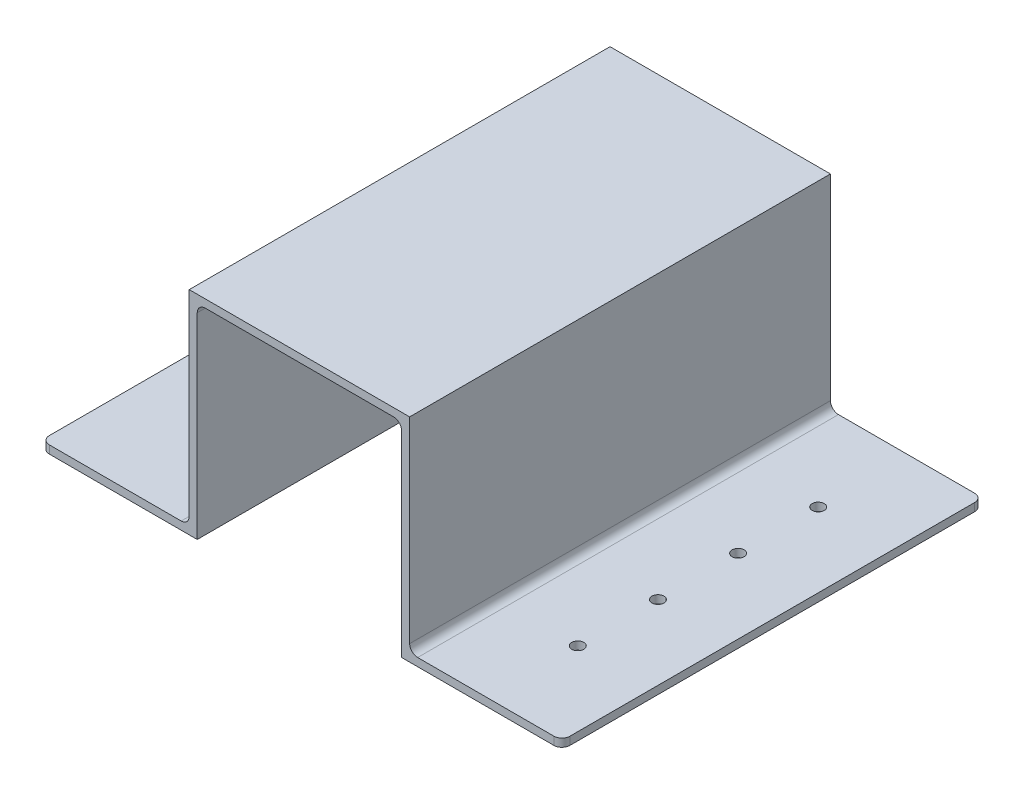
ISO-10303-21;
HEADER;
FILE_DESCRIPTION(('STEP AP214'),'2;1');
FILE_NAME('part.step','',(''),(''),'','','');
FILE_SCHEMA(('AUTOMOTIVE_DESIGN { 1 0 10303 214 1 1 1 1 }'));
ENDSEC;
DATA;
#1=APPLICATION_CONTEXT('core data for automotive mechanical design processes');
#2=APPLICATION_PROTOCOL_DEFINITION('international standard','automotive_design',2000,#1);
#3=PRODUCT_CONTEXT('',#1,'mechanical');
#4=PRODUCT('Part','Part','',(#3));
#5=PRODUCT_RELATED_PRODUCT_CATEGORY('part','',(#4));
#6=PRODUCT_DEFINITION_FORMATION('','',#4);
#7=PRODUCT_DEFINITION_CONTEXT('part definition',#1,'design');
#8=PRODUCT_DEFINITION('design','',#6,#7);
#9=PRODUCT_DEFINITION_SHAPE('','',#8);
#10=(LENGTH_UNIT() NAMED_UNIT(*) SI_UNIT(.MILLI.,.METRE.));
#11=(NAMED_UNIT(*) PLANE_ANGLE_UNIT() SI_UNIT($,.RADIAN.));
#12=(NAMED_UNIT(*) SI_UNIT($,.STERADIAN.) SOLID_ANGLE_UNIT());
#13=UNCERTAINTY_MEASURE_WITH_UNIT(LENGTH_MEASURE(1.E-05),#10,'distance_accuracy_value','');
#14=(GEOMETRIC_REPRESENTATION_CONTEXT(3) GLOBAL_UNCERTAINTY_ASSIGNED_CONTEXT((#13)) GLOBAL_UNIT_ASSIGNED_CONTEXT((#10,
#11,#12)) REPRESENTATION_CONTEXT('',''));
#15=CARTESIAN_POINT('',(0.,0.,0.));
#16=DIRECTION('',(0.,0.,1.));
#17=DIRECTION('',(1.,0.,0.));
#18=AXIS2_PLACEMENT_3D('',#15,#16,#17);
#19=CARTESIAN_POINT('',(-42.0847791453511,1.42606528480282,105.));
#20=DIRECTION('',(-1.,0.,0.));
#21=DIRECTION('',(0.,-1.,0.));
#22=AXIS2_PLACEMENT_3D('',#19,#20,#21);
#23=PLANE('',#22);
#24=DIRECTION('',(0.,1.,0.));
#25=VECTOR('',#24,1.);
#26=CARTESIAN_POINT('',(-42.0847791453511,1.42606528480282,0.));
#27=LINE('',#26,#25);
#28=CARTESIAN_POINT('',(-42.0847791453511,-49.5739347151972,0.));
#29=VERTEX_POINT('',#28);
#30=CARTESIAN_POINT('',(-42.0847791453511,-0.573934715197176,0.));
#31=VERTEX_POINT('',#30);
#32=EDGE_CURVE('E219',#29,#31,#27,.T.);
#33=ORIENTED_EDGE('',*,*,#32,.T.);
#34=DIRECTION('',(0.,0.,-1.));
#35=VECTOR('',#34,1.);
#36=CARTESIAN_POINT('',(-42.0847791453511,-0.573934715197176,105.));
#37=LINE('',#36,#35);
#38=CARTESIAN_POINT('',(-42.0847791453511,-0.573934715197176,105.));
#39=VERTEX_POINT('',#38);
#40=EDGE_CURVE('E272',#31,#39,#37,.F.);
#41=ORIENTED_EDGE('',*,*,#40,.T.);
#42=DIRECTION('',(0.,1.,0.));
#43=VECTOR('',#42,1.);
#44=CARTESIAN_POINT('',(-42.0847791453511,1.42606528480282,105.));
#45=LINE('',#44,#43);
#46=CARTESIAN_POINT('',(-42.0847791453511,-49.5739347151972,105.));
#47=VERTEX_POINT('',#46);
#48=EDGE_CURVE('E242',#47,#39,#45,.T.);
#49=ORIENTED_EDGE('',*,*,#48,.F.);
#50=DIRECTION('',(0.,0.,-1.));
#51=VECTOR('',#50,1.);
#52=CARTESIAN_POINT('',(-42.0847791453511,-49.5739347151972,105.));
#53=LINE('',#52,#51);
#54=EDGE_CURVE('E218',#47,#29,#53,.T.);
#55=ORIENTED_EDGE('',*,*,#54,.T.);
#56=EDGE_LOOP('',(#33,#41,#49,#55));
#57=FACE_BOUND('',#56,.T.);
#58=ADVANCED_FACE('F33',(#57),#23,.F.);
#59=CARTESIAN_POINT('',(-42.0847791453511,1.42606528480282,105.));
#60=DIRECTION('',(0.,1.,0.));
#61=DIRECTION('',(0.,0.,1.));
#62=AXIS2_PLACEMENT_3D('',#59,#60,#61);
#63=PLANE('',#62);
#64=DIRECTION('',(1.,0.,0.));
#65=VECTOR('',#64,1.);
#66=CARTESIAN_POINT('',(-42.0847791453511,1.42606528480282,0.));
#67=LINE('',#66,#65);
#68=CARTESIAN_POINT('',(-40.0847791453511,1.42606528480282,0.));
#69=VERTEX_POINT('',#68);
#70=CARTESIAN_POINT('',(6.91522085464886,1.42606528480282,0.));
#71=VERTEX_POINT('',#70);
#72=EDGE_CURVE('E222',#69,#71,#67,.T.);
#73=ORIENTED_EDGE('',*,*,#72,.T.);
#74=DIRECTION('',(0.,0.,-1.));
#75=VECTOR('',#74,1.);
#76=CARTESIAN_POINT('',(6.91522085464887,1.42606528480282,105.));
#77=LINE('',#76,#75);
#78=CARTESIAN_POINT('',(6.91522085464886,1.42606528480282,105.));
#79=VERTEX_POINT('',#78);
#80=EDGE_CURVE('E280',#71,#79,#77,.F.);
#81=ORIENTED_EDGE('',*,*,#80,.T.);
#82=DIRECTION('',(1.,0.,0.));
#83=VECTOR('',#82,1.);
#84=CARTESIAN_POINT('',(-42.0847791453511,1.42606528480282,105.));
#85=LINE('',#84,#83);
#86=CARTESIAN_POINT('',(-40.0847791453511,1.42606528480282,105.));
#87=VERTEX_POINT('',#86);
#88=EDGE_CURVE('E184',#87,#79,#85,.T.);
#89=ORIENTED_EDGE('',*,*,#88,.F.);
#90=DIRECTION('',(0.,0.,-1.));
#91=VECTOR('',#90,1.);
#92=CARTESIAN_POINT('',(-40.0847791453511,1.42606528480282,0.));
#93=LINE('',#92,#91);
#94=EDGE_CURVE('E269',#87,#69,#93,.T.);
#95=ORIENTED_EDGE('',*,*,#94,.T.);
#96=EDGE_LOOP('',(#73,#81,#89,#95));
#97=FACE_BOUND('',#96,.T.);
#98=ADVANCED_FACE('F406',(#97),#63,.F.);
#99=CARTESIAN_POINT('',(8.91522085464887,1.42606528480282,105.));
#100=DIRECTION('',(1.,0.,0.));
#101=DIRECTION('',(0.,1.,0.));
#102=AXIS2_PLACEMENT_3D('',#99,#100,#101);
#103=PLANE('',#102);
#104=DIRECTION('',(0.,-1.,0.));
#105=VECTOR('',#104,1.);
#106=CARTESIAN_POINT('',(8.91522085464887,1.42606528480282,105.));
#107=LINE('',#106,#105);
#108=CARTESIAN_POINT('',(8.91522085464887,-0.573934715197176,105.));
#109=VERTEX_POINT('',#108);
#110=CARTESIAN_POINT('',(8.91522085464888,-49.5739347151972,105.));
#111=VERTEX_POINT('',#110);
#112=EDGE_CURVE('E171',#109,#111,#107,.T.);
#113=ORIENTED_EDGE('',*,*,#112,.F.);
#114=DIRECTION('',(0.,0.,-1.));
#115=VECTOR('',#114,1.);
#116=CARTESIAN_POINT('',(8.91522085464887,-0.573934715197176,0.));
#117=LINE('',#116,#115);
#118=CARTESIAN_POINT('',(8.91522085464887,-0.573934715197176,0.));
#119=VERTEX_POINT('',#118);
#120=EDGE_CURVE('E278',#109,#119,#117,.T.);
#121=ORIENTED_EDGE('',*,*,#120,.T.);
#122=DIRECTION('',(0.,-1.,0.));
#123=VECTOR('',#122,1.);
#124=CARTESIAN_POINT('',(8.91522085464887,1.42606528480282,0.));
#125=LINE('',#124,#123);
#126=CARTESIAN_POINT('',(8.91522085464888,-49.5739347151972,0.));
#127=VERTEX_POINT('',#126);
#128=EDGE_CURVE('E190',#119,#127,#125,.T.);
#129=ORIENTED_EDGE('',*,*,#128,.T.);
#130=DIRECTION('',(0.,0.,-1.));
#131=VECTOR('',#130,1.);
#132=CARTESIAN_POINT('',(8.91522085464888,-49.5739347151972,105.));
#133=LINE('',#132,#131);
#134=EDGE_CURVE('E187',#111,#127,#133,.T.);
#135=ORIENTED_EDGE('',*,*,#134,.F.);
#136=EDGE_LOOP('',(#113,#121,#129,#135));
#137=FACE_BOUND('',#136,.T.);
#138=ADVANCED_FACE('F188',(#137),#103,.F.);
#139=CARTESIAN_POINT('',(8.91522085464888,-49.5739347151972,105.));
#140=DIRECTION('',(0.,1.,0.));
#141=DIRECTION('',(0.,0.,1.));
#142=AXIS2_PLACEMENT_3D('',#139,#140,#141);
#143=PLANE('',#142);
#144=CARTESIAN_POINT('',(30.3725806176562,-49.5739347151972,82.5));
#145=DIRECTION('',(0.,1.,0.));
#146=DIRECTION('',(0.,0.,1.));
#147=AXIS2_PLACEMENT_3D('',#144,#145,#146);
#148=CIRCLE('',#147,1.5);
#149=CARTESIAN_POINT('',(30.3725806176562,-49.5739347151972,84.));
#150=VERTEX_POINT('',#149);
#151=EDGE_CURVE('E223',#150,#150,#148,.T.);
#152=ORIENTED_EDGE('',*,*,#151,.T.);
#153=EDGE_LOOP('',(#152));
#154=FACE_BOUND('',#153,.T.);
#155=CARTESIAN_POINT('',(30.3725806176562,-49.5739347151972,62.5));
#156=DIRECTION('',(0.,1.,0.));
#157=DIRECTION('',(0.,0.,1.));
#158=AXIS2_PLACEMENT_3D('',#155,#156,#157);
#159=CIRCLE('',#158,1.5);
#160=CARTESIAN_POINT('',(30.3725806176562,-49.5739347151972,64.));
#161=VERTEX_POINT('',#160);
#162=EDGE_CURVE('E412',#161,#161,#159,.T.);
#163=ORIENTED_EDGE('',*,*,#162,.T.);
#164=EDGE_LOOP('',(#163));
#165=FACE_BOUND('',#164,.T.);
#166=CARTESIAN_POINT('',(30.3725806176562,-49.5739347151972,42.5));
#167=DIRECTION('',(0.,1.,0.));
#168=DIRECTION('',(0.,0.,1.));
#169=AXIS2_PLACEMENT_3D('',#166,#167,#168);
#170=CIRCLE('',#169,1.5);
#171=CARTESIAN_POINT('',(30.3725806176562,-49.5739347151972,44.));
#172=VERTEX_POINT('',#171);
#173=EDGE_CURVE('E415',#172,#172,#170,.T.);
#174=ORIENTED_EDGE('',*,*,#173,.T.);
#175=EDGE_LOOP('',(#174));
#176=FACE_BOUND('',#175,.T.);
#177=CARTESIAN_POINT('',(30.3725806176562,-49.5739347151972,22.5));
#178=DIRECTION('',(0.,1.,0.));
#179=DIRECTION('',(0.,0.,1.));
#180=AXIS2_PLACEMENT_3D('',#177,#178,#179);
#181=CIRCLE('',#180,1.5);
#182=CARTESIAN_POINT('',(30.3725806176562,-49.5739347151972,24.));
#183=VERTEX_POINT('',#182);
#184=EDGE_CURVE('E310',#183,#183,#181,.T.);
#185=ORIENTED_EDGE('',*,*,#184,.T.);
#186=EDGE_LOOP('',(#185));
#187=FACE_BOUND('',#186,.T.);
#188=DIRECTION('',(0.,0.,-1.));
#189=VECTOR('',#188,1.);
#190=CARTESIAN_POINT('',(48.9152208546489,-49.5739347151972,105.));
#191=LINE('',#190,#189);
#192=CARTESIAN_POINT('',(48.9152208546489,-49.5739347151972,103.));
#193=VERTEX_POINT('',#192);
#194=CARTESIAN_POINT('',(48.9152208546489,-49.5739347151972,2.));
#195=VERTEX_POINT('',#194);
#196=EDGE_CURVE('E195',#193,#195,#191,.T.);
#197=ORIENTED_EDGE('',*,*,#196,.F.);
#198=CARTESIAN_POINT('',(46.9152208546489,-49.5739347151972,103.));
#199=DIRECTION('',(0.,1.,0.));
#200=DIRECTION('',(0.,0.,1.));
#201=AXIS2_PLACEMENT_3D('',#198,#199,#200);
#202=CIRCLE('',#201,2.);
#203=CARTESIAN_POINT('',(46.9152208546489,-49.5739347151972,105.));
#204=VERTEX_POINT('',#203);
#205=EDGE_CURVE('E200',#193,#204,#202,.F.);
#206=ORIENTED_EDGE('',*,*,#205,.T.);
#207=DIRECTION('',(1.,0.,0.));
#208=VECTOR('',#207,1.);
#209=CARTESIAN_POINT('',(8.91522085464888,-49.5739347151972,105.));
#210=LINE('',#209,#208);
#211=EDGE_CURVE('E176',#111,#204,#210,.T.);
#212=ORIENTED_EDGE('',*,*,#211,.F.);
#213=ORIENTED_EDGE('',*,*,#134,.T.);
#214=DIRECTION('',(1.,0.,0.));
#215=VECTOR('',#214,1.);
#216=CARTESIAN_POINT('',(8.91522085464888,-49.5739347151972,0.));
#217=LINE('',#216,#215);
#218=CARTESIAN_POINT('',(46.9152208546489,-49.5739347151972,0.));
#219=VERTEX_POINT('',#218);
#220=EDGE_CURVE('E227',#127,#219,#217,.T.);
#221=ORIENTED_EDGE('',*,*,#220,.T.);
#222=CARTESIAN_POINT('',(46.9152208546489,-49.5739347151972,2.));
#223=DIRECTION('',(0.,1.,0.));
#224=DIRECTION('',(0.,0.,1.));
#225=AXIS2_PLACEMENT_3D('',#222,#223,#224);
#226=CIRCLE('',#225,2.);
#227=EDGE_CURVE('E324',#219,#195,#226,.F.);
#228=ORIENTED_EDGE('',*,*,#227,.T.);
#229=EDGE_LOOP('',(#197,#206,#212,#213,#221,#228));
#230=FACE_BOUND('',#229,.T.);
#231=ADVANCED_FACE('F198',(#154,#165,#176,#187,#230),#143,.F.);
#232=CARTESIAN_POINT('',(48.9152208546489,-47.5739347151972,105.));
#233=DIRECTION('',(-1.,0.,0.));
#234=DIRECTION('',(0.,-1.,0.));
#235=AXIS2_PLACEMENT_3D('',#232,#233,#234);
#236=PLANE('',#235);
#237=DIRECTION('',(0.,0.,-1.));
#238=VECTOR('',#237,1.);
#239=CARTESIAN_POINT('',(48.9152208546489,-47.5739347151972,105.));
#240=LINE('',#239,#238);
#241=CARTESIAN_POINT('',(48.9152208546489,-47.5739347151972,103.));
#242=VERTEX_POINT('',#241);
#243=CARTESIAN_POINT('',(48.9152208546489,-47.5739347151972,2.));
#244=VERTEX_POINT('',#243);
#245=EDGE_CURVE('E256',#242,#244,#240,.T.);
#246=ORIENTED_EDGE('',*,*,#245,.F.);
#247=DIRECTION('',(0.,1.,0.));
#248=VECTOR('',#247,1.);
#249=CARTESIAN_POINT('',(48.9152208546489,-47.5739347151972,103.));
#250=LINE('',#249,#248);
#251=EDGE_CURVE('E322',#242,#193,#250,.F.);
#252=ORIENTED_EDGE('',*,*,#251,.T.);
#253=ORIENTED_EDGE('',*,*,#196,.T.);
#254=DIRECTION('',(0.,1.,0.));
#255=VECTOR('',#254,1.);
#256=CARTESIAN_POINT('',(48.9152208546489,-47.5739347151972,2.));
#257=LINE('',#256,#255);
#258=EDGE_CURVE('E319',#195,#244,#257,.T.);
#259=ORIENTED_EDGE('',*,*,#258,.T.);
#260=EDGE_LOOP('',(#246,#252,#253,#259));
#261=FACE_BOUND('',#260,.T.);
#262=ADVANCED_FACE('F346',(#261),#236,.F.);
#263=CARTESIAN_POINT('',(10.9152208546489,-47.5739347151972,105.));
#264=DIRECTION('',(0.,-1.,0.));
#265=DIRECTION('',(0.,0.,-1.));
#266=AXIS2_PLACEMENT_3D('',#263,#264,#265);
#267=PLANE('',#266);
#268=CARTESIAN_POINT('',(30.3725806176562,-47.5739347151972,82.5));
#269=DIRECTION('',(0.,1.,0.));
#270=DIRECTION('',(0.,0.,1.));
#271=AXIS2_PLACEMENT_3D('',#268,#269,#270);
#272=CIRCLE('',#271,1.5);
#273=CARTESIAN_POINT('',(30.3725806176562,-47.5739347151972,84.));
#274=VERTEX_POINT('',#273);
#275=EDGE_CURVE('E429',#274,#274,#272,.T.);
#276=ORIENTED_EDGE('',*,*,#275,.F.);
#277=EDGE_LOOP('',(#276));
#278=FACE_BOUND('',#277,.T.);
#279=CARTESIAN_POINT('',(30.3725806176562,-47.5739347151972,62.5));
#280=DIRECTION('',(0.,1.,0.));
#281=DIRECTION('',(0.,0.,1.));
#282=AXIS2_PLACEMENT_3D('',#279,#280,#281);
#283=CIRCLE('',#282,1.5);
#284=CARTESIAN_POINT('',(30.3725806176562,-47.5739347151972,64.));
#285=VERTEX_POINT('',#284);
#286=EDGE_CURVE('E432',#285,#285,#283,.T.);
#287=ORIENTED_EDGE('',*,*,#286,.F.);
#288=EDGE_LOOP('',(#287));
#289=FACE_BOUND('',#288,.T.);
#290=CARTESIAN_POINT('',(30.3725806176562,-47.5739347151972,42.5));
#291=DIRECTION('',(0.,1.,0.));
#292=DIRECTION('',(0.,0.,-1.));
#293=AXIS2_PLACEMENT_3D('',#290,#291,#292);
#294=CIRCLE('',#293,1.5);
#295=CARTESIAN_POINT('',(30.3725806176562,-47.5739347151972,41.));
#296=VERTEX_POINT('',#295);
#297=EDGE_CURVE('E438',#296,#296,#294,.T.);
#298=ORIENTED_EDGE('',*,*,#297,.F.);
#299=EDGE_LOOP('',(#298));
#300=FACE_BOUND('',#299,.T.);
#301=CARTESIAN_POINT('',(30.3725806176562,-47.5739347151972,22.5));
#302=DIRECTION('',(0.,1.,0.));
#303=DIRECTION('',(0.,0.,-1.));
#304=AXIS2_PLACEMENT_3D('',#301,#302,#303);
#305=CIRCLE('',#304,1.5);
#306=CARTESIAN_POINT('',(30.3725806176562,-47.5739347151972,21.));
#307=VERTEX_POINT('',#306);
#308=EDGE_CURVE('E435',#307,#307,#305,.T.);
#309=ORIENTED_EDGE('',*,*,#308,.F.);
#310=EDGE_LOOP('',(#309));
#311=FACE_BOUND('',#310,.T.);
#312=DIRECTION('',(-1.,0.,0.));
#313=VECTOR('',#312,1.);
#314=CARTESIAN_POINT('',(10.9152208546489,-47.5739347151972,105.));
#315=LINE('',#314,#313);
#316=CARTESIAN_POINT('',(46.9152208546489,-47.5739347151972,105.));
#317=VERTEX_POINT('',#316);
#318=CARTESIAN_POINT('',(12.9152208546489,-47.5739347151972,105.));
#319=VERTEX_POINT('',#318);
#320=EDGE_CURVE('E201',#317,#319,#315,.T.);
#321=ORIENTED_EDGE('',*,*,#320,.F.);
#322=CARTESIAN_POINT('',(46.9152208546489,-47.5739347151972,103.));
#323=DIRECTION('',(0.,-1.,0.));
#324=DIRECTION('',(0.,0.,-1.));
#325=AXIS2_PLACEMENT_3D('',#322,#323,#324);
#326=CIRCLE('',#325,2.);
#327=EDGE_CURVE('E317',#317,#242,#326,.F.);
#328=ORIENTED_EDGE('',*,*,#327,.T.);
#329=ORIENTED_EDGE('',*,*,#245,.T.);
#330=CARTESIAN_POINT('',(46.9152208546489,-47.5739347151972,2.));
#331=DIRECTION('',(0.,-1.,0.));
#332=DIRECTION('',(0.,0.,-1.));
#333=AXIS2_PLACEMENT_3D('',#330,#331,#332);
#334=CIRCLE('',#333,2.);
#335=CARTESIAN_POINT('',(46.9152208546489,-47.5739347151972,0.));
#336=VERTEX_POINT('',#335);
#337=EDGE_CURVE('E315',#244,#336,#334,.F.);
#338=ORIENTED_EDGE('',*,*,#337,.T.);
#339=DIRECTION('',(-1.,0.,0.));
#340=VECTOR('',#339,1.);
#341=CARTESIAN_POINT('',(10.9152208546489,-47.5739347151972,0.));
#342=LINE('',#341,#340);
#343=CARTESIAN_POINT('',(12.9152208546489,-47.5739347151972,0.));
#344=VERTEX_POINT('',#343);
#345=EDGE_CURVE('E229',#336,#344,#342,.T.);
#346=ORIENTED_EDGE('',*,*,#345,.T.);
#347=DIRECTION('',(0.,0.,-1.));
#348=VECTOR('',#347,1.);
#349=CARTESIAN_POINT('',(12.9152208546489,-47.5739347151972,105.));
#350=LINE('',#349,#348);
#351=EDGE_CURVE('E288',#344,#319,#350,.F.);
#352=ORIENTED_EDGE('',*,*,#351,.T.);
#353=EDGE_LOOP('',(#321,#328,#329,#338,#346,#352));
#354=FACE_BOUND('',#353,.T.);
#355=ADVANCED_FACE('F350',(#278,#289,#300,#311,#354),#267,.F.);
#356=CARTESIAN_POINT('',(10.9152208546489,3.42606528480282,105.));
#357=DIRECTION('',(-1.,0.,0.));
#358=DIRECTION('',(0.,-1.,0.));
#359=AXIS2_PLACEMENT_3D('',#356,#357,#358);
#360=PLANE('',#359);
#361=DIRECTION('',(0.,1.,0.));
#362=VECTOR('',#361,1.);
#363=CARTESIAN_POINT('',(10.9152208546489,3.42606528480282,105.));
#364=LINE('',#363,#362);
#365=CARTESIAN_POINT('',(10.9152208546489,-45.5739347151972,105.));
#366=VERTEX_POINT('',#365);
#367=CARTESIAN_POINT('',(10.9152208546489,3.42606528480282,105.));
#368=VERTEX_POINT('',#367);
#369=EDGE_CURVE('E203',#366,#368,#364,.T.);
#370=ORIENTED_EDGE('',*,*,#369,.F.);
#371=DIRECTION('',(0.,0.,-1.));
#372=VECTOR('',#371,1.);
#373=CARTESIAN_POINT('',(10.9152208546489,-45.5739347151972,0.));
#374=LINE('',#373,#372);
#375=CARTESIAN_POINT('',(10.9152208546489,-45.5739347151972,0.));
#376=VERTEX_POINT('',#375);
#377=EDGE_CURVE('E285',#366,#376,#374,.T.);
#378=ORIENTED_EDGE('',*,*,#377,.T.);
#379=DIRECTION('',(0.,1.,0.));
#380=VECTOR('',#379,1.);
#381=CARTESIAN_POINT('',(10.9152208546489,3.42606528480282,0.));
#382=LINE('',#381,#380);
#383=CARTESIAN_POINT('',(10.9152208546489,3.42606528480282,0.));
#384=VERTEX_POINT('',#383);
#385=EDGE_CURVE('E231',#376,#384,#382,.T.);
#386=ORIENTED_EDGE('',*,*,#385,.T.);
#387=DIRECTION('',(0.,0.,-1.));
#388=VECTOR('',#387,1.);
#389=CARTESIAN_POINT('',(10.9152208546489,3.42606528480282,105.));
#390=LINE('',#389,#388);
#391=EDGE_CURVE('E253',#368,#384,#390,.T.);
#392=ORIENTED_EDGE('',*,*,#391,.F.);
#393=EDGE_LOOP('',(#370,#378,#386,#392));
#394=FACE_BOUND('',#393,.T.);
#395=ADVANCED_FACE('F361',(#394),#360,.F.);
#396=CARTESIAN_POINT('',(-44.0847791453511,3.42606528480282,105.));
#397=DIRECTION('',(0.,-1.,0.));
#398=DIRECTION('',(0.,0.,-1.));
#399=AXIS2_PLACEMENT_3D('',#396,#397,#398);
#400=PLANE('',#399);
#401=DIRECTION('',(-1.,0.,0.));
#402=VECTOR('',#401,1.);
#403=CARTESIAN_POINT('',(-44.0847791453511,3.42606528480282,0.));
#404=LINE('',#403,#402);
#405=CARTESIAN_POINT('',(-44.0847791453511,3.42606528480282,0.));
#406=VERTEX_POINT('',#405);
#407=EDGE_CURVE('E233',#384,#406,#404,.T.);
#408=ORIENTED_EDGE('',*,*,#407,.T.);
#409=DIRECTION('',(0.,0.,-1.));
#410=VECTOR('',#409,1.);
#411=CARTESIAN_POINT('',(-44.0847791453511,3.42606528480282,105.));
#412=LINE('',#411,#410);
#413=CARTESIAN_POINT('',(-44.0847791453511,3.42606528480282,105.));
#414=VERTEX_POINT('',#413);
#415=EDGE_CURVE('E250',#414,#406,#412,.T.);
#416=ORIENTED_EDGE('',*,*,#415,.F.);
#417=DIRECTION('',(-1.,0.,0.));
#418=VECTOR('',#417,1.);
#419=CARTESIAN_POINT('',(-44.0847791453511,3.42606528480282,105.));
#420=LINE('',#419,#418);
#421=EDGE_CURVE('E208',#368,#414,#420,.T.);
#422=ORIENTED_EDGE('',*,*,#421,.F.);
#423=ORIENTED_EDGE('',*,*,#391,.T.);
#424=EDGE_LOOP('',(#408,#416,#422,#423));
#425=FACE_BOUND('',#424,.T.);
#426=ADVANCED_FACE('F367',(#425),#400,.F.);
#427=CARTESIAN_POINT('',(-44.0847791453511,-47.5739347151972,105.));
#428=DIRECTION('',(1.,0.,0.));
#429=DIRECTION('',(0.,0.,-1.));
#430=AXIS2_PLACEMENT_3D('',#427,#428,#429);
#431=PLANE('',#430);
#432=DIRECTION('',(0.,-1.,0.));
#433=VECTOR('',#432,1.);
#434=CARTESIAN_POINT('',(-44.0847791453511,-47.5739347151972,0.));
#435=LINE('',#434,#433);
#436=CARTESIAN_POINT('',(-44.0847791453511,-45.5739347151972,0.));
#437=VERTEX_POINT('',#436);
#438=EDGE_CURVE('E235',#406,#437,#435,.T.);
#439=ORIENTED_EDGE('',*,*,#438,.T.);
#440=DIRECTION('',(0.,0.,-1.));
#441=VECTOR('',#440,1.);
#442=CARTESIAN_POINT('',(-44.0847791453511,-45.5739347151972,105.));
#443=LINE('',#442,#441);
#444=CARTESIAN_POINT('',(-44.0847791453511,-45.5739347151972,105.));
#445=VERTEX_POINT('',#444);
#446=EDGE_CURVE('E263',#437,#445,#443,.F.);
#447=ORIENTED_EDGE('',*,*,#446,.T.);
#448=DIRECTION('',(0.,-1.,0.));
#449=VECTOR('',#448,1.);
#450=CARTESIAN_POINT('',(-44.0847791453511,-47.5739347151972,105.));
#451=LINE('',#450,#449);
#452=EDGE_CURVE('E210',#414,#445,#451,.T.);
#453=ORIENTED_EDGE('',*,*,#452,.F.);
#454=ORIENTED_EDGE('',*,*,#415,.T.);
#455=EDGE_LOOP('',(#439,#447,#453,#454));
#456=FACE_BOUND('',#455,.T.);
#457=ADVANCED_FACE('F371',(#456),#431,.F.);
#458=CARTESIAN_POINT('',(-80.9994986713658,-47.5739347151972,105.));
#459=DIRECTION('',(0.,-1.,0.));
#460=DIRECTION('',(0.,0.,-1.));
#461=AXIS2_PLACEMENT_3D('',#458,#459,#460);
#462=PLANE('',#461);
#463=CARTESIAN_POINT('',(-63.5421389083584,-47.5739347151972,62.5));
#464=DIRECTION('',(0.,1.,0.));
#465=DIRECTION('',(0.,0.,-1.));
#466=AXIS2_PLACEMENT_3D('',#463,#464,#465);
#467=CIRCLE('',#466,1.5);
#468=CARTESIAN_POINT('',(-63.5421389083584,-47.5739347151972,61.));
#469=VERTEX_POINT('',#468);
#470=EDGE_CURVE('E426',#469,#469,#467,.T.);
#471=ORIENTED_EDGE('',*,*,#470,.F.);
#472=EDGE_LOOP('',(#471));
#473=FACE_BOUND('',#472,.T.);
#474=CARTESIAN_POINT('',(-63.5421389083585,-47.5739347151972,82.5));
#475=DIRECTION('',(0.,1.,0.));
#476=DIRECTION('',(0.,0.,-1.));
#477=AXIS2_PLACEMENT_3D('',#474,#475,#476);
#478=CIRCLE('',#477,1.5);
#479=CARTESIAN_POINT('',(-63.5421389083585,-47.5739347151972,81.));
#480=VERTEX_POINT('',#479);
#481=EDGE_CURVE('E423',#480,#480,#478,.T.);
#482=ORIENTED_EDGE('',*,*,#481,.F.);
#483=EDGE_LOOP('',(#482));
#484=FACE_BOUND('',#483,.T.);
#485=CARTESIAN_POINT('',(-63.5421389083585,-47.5739347151972,22.5));
#486=DIRECTION('',(0.,1.,0.));
#487=DIRECTION('',(0.,0.,1.));
#488=AXIS2_PLACEMENT_3D('',#485,#486,#487);
#489=CIRCLE('',#488,1.5);
#490=CARTESIAN_POINT('',(-63.5421389083585,-47.5739347151972,24.));
#491=VERTEX_POINT('',#490);
#492=EDGE_CURVE('E422',#491,#491,#489,.T.);
#493=ORIENTED_EDGE('',*,*,#492,.F.);
#494=EDGE_LOOP('',(#493));
#495=FACE_BOUND('',#494,.T.);
#496=CARTESIAN_POINT('',(-63.5421389083584,-47.5739347151972,42.5));
#497=DIRECTION('',(0.,1.,0.));
#498=DIRECTION('',(0.,0.,1.));
#499=AXIS2_PLACEMENT_3D('',#496,#497,#498);
#500=CIRCLE('',#499,1.5);
#501=CARTESIAN_POINT('',(-63.5421389083584,-47.5739347151972,44.));
#502=VERTEX_POINT('',#501);
#503=EDGE_CURVE('E301',#502,#502,#500,.T.);
#504=ORIENTED_EDGE('',*,*,#503,.F.);
#505=EDGE_LOOP('',(#504));
#506=FACE_BOUND('',#505,.T.);
#507=DIRECTION('',(0.,0.,-1.));
#508=VECTOR('',#507,1.);
#509=CARTESIAN_POINT('',(-80.9994986713658,-47.5739347151972,105.));
#510=LINE('',#509,#508);
#511=CARTESIAN_POINT('',(-80.9994986713658,-47.5739347151972,103.));
#512=VERTEX_POINT('',#511);
#513=CARTESIAN_POINT('',(-80.9994986713658,-47.5739347151972,2.));
#514=VERTEX_POINT('',#513);
#515=EDGE_CURVE('E248',#512,#514,#510,.T.);
#516=ORIENTED_EDGE('',*,*,#515,.F.);
#517=CARTESIAN_POINT('',(-78.9994986713658,-47.5739347151972,103.));
#518=DIRECTION('',(0.,-1.,0.));
#519=DIRECTION('',(0.,0.,-1.));
#520=AXIS2_PLACEMENT_3D('',#517,#518,#519);
#521=CIRCLE('',#520,2.);
#522=CARTESIAN_POINT('',(-78.9994986713658,-47.5739347151972,105.));
#523=VERTEX_POINT('',#522);
#524=EDGE_CURVE('E337',#512,#523,#521,.F.);
#525=ORIENTED_EDGE('',*,*,#524,.T.);
#526=DIRECTION('',(-1.,0.,0.));
#527=VECTOR('',#526,1.);
#528=CARTESIAN_POINT('',(-80.9994986713658,-47.5739347151972,105.));
#529=LINE('',#528,#527);
#530=CARTESIAN_POINT('',(-46.0847791453511,-47.5739347151972,105.));
#531=VERTEX_POINT('',#530);
#532=EDGE_CURVE('E213',#531,#523,#529,.T.);
#533=ORIENTED_EDGE('',*,*,#532,.F.);
#534=DIRECTION('',(0.,0.,-1.));
#535=VECTOR('',#534,1.);
#536=CARTESIAN_POINT('',(-46.0847791453511,-47.5739347151972,0.));
#537=LINE('',#536,#535);
#538=CARTESIAN_POINT('',(-46.0847791453511,-47.5739347151972,0.));
#539=VERTEX_POINT('',#538);
#540=EDGE_CURVE('E194',#531,#539,#537,.T.);
#541=ORIENTED_EDGE('',*,*,#540,.T.);
#542=DIRECTION('',(-1.,0.,0.));
#543=VECTOR('',#542,1.);
#544=CARTESIAN_POINT('',(-80.9994986713658,-47.5739347151972,0.));
#545=LINE('',#544,#543);
#546=CARTESIAN_POINT('',(-78.9994986713658,-47.5739347151972,0.));
#547=VERTEX_POINT('',#546);
#548=EDGE_CURVE('E238',#539,#547,#545,.T.);
#549=ORIENTED_EDGE('',*,*,#548,.T.);
#550=CARTESIAN_POINT('',(-78.9994986713658,-47.5739347151972,2.));
#551=DIRECTION('',(0.,-1.,0.));
#552=DIRECTION('',(0.,0.,-1.));
#553=AXIS2_PLACEMENT_3D('',#550,#551,#552);
#554=CIRCLE('',#553,2.);
#555=EDGE_CURVE('E53',#547,#514,#554,.F.);
#556=ORIENTED_EDGE('',*,*,#555,.T.);
#557=EDGE_LOOP('',(#516,#525,#533,#541,#549,#556));
#558=FACE_BOUND('',#557,.T.);
#559=ADVANCED_FACE('F378',(#473,#484,#495,#506,#558),#462,.F.);
#560=CARTESIAN_POINT('',(-80.9994986713658,-49.5739347151972,105.));
#561=DIRECTION('',(1.,0.,0.));
#562=DIRECTION('',(0.,0.,-1.));
#563=AXIS2_PLACEMENT_3D('',#560,#561,#562);
#564=PLANE('',#563);
#565=DIRECTION('',(0.,0.,-1.));
#566=VECTOR('',#565,1.);
#567=CARTESIAN_POINT('',(-80.9994986713658,-49.5739347151972,105.));
#568=LINE('',#567,#566);
#569=CARTESIAN_POINT('',(-80.9994986713658,-49.5739347151972,103.));
#570=VERTEX_POINT('',#569);
#571=CARTESIAN_POINT('',(-80.9994986713658,-49.5739347151972,2.));
#572=VERTEX_POINT('',#571);
#573=EDGE_CURVE('E245',#570,#572,#568,.T.);
#574=ORIENTED_EDGE('',*,*,#573,.F.);
#575=DIRECTION('',(0.,-1.,0.));
#576=VECTOR('',#575,1.);
#577=CARTESIAN_POINT('',(-80.9994986713658,-49.5739347151972,103.));
#578=LINE('',#577,#576);
#579=EDGE_CURVE('E334',#570,#512,#578,.F.);
#580=ORIENTED_EDGE('',*,*,#579,.T.);
#581=ORIENTED_EDGE('',*,*,#515,.T.);
#582=DIRECTION('',(0.,-1.,0.));
#583=VECTOR('',#582,1.);
#584=CARTESIAN_POINT('',(-80.9994986713658,-49.5739347151972,2.));
#585=LINE('',#584,#583);
#586=EDGE_CURVE('E331',#514,#572,#585,.T.);
#587=ORIENTED_EDGE('',*,*,#586,.T.);
#588=EDGE_LOOP('',(#574,#580,#581,#587));
#589=FACE_BOUND('',#588,.T.);
#590=ADVANCED_FACE('F390',(#589),#564,.F.);
#591=CARTESIAN_POINT('',(-42.0847791453511,-49.5739347151972,105.));
#592=DIRECTION('',(0.,1.,0.));
#593=DIRECTION('',(0.,0.,1.));
#594=AXIS2_PLACEMENT_3D('',#591,#592,#593);
#595=PLANE('',#594);
#596=CARTESIAN_POINT('',(-63.5421389083584,-49.5739347151972,62.5));
#597=DIRECTION('',(0.,1.,0.));
#598=DIRECTION('',(0.,0.,1.));
#599=AXIS2_PLACEMENT_3D('',#596,#597,#598);
#600=CIRCLE('',#599,1.5);
#601=CARTESIAN_POINT('',(-63.5421389083584,-49.5739347151972,64.));
#602=VERTEX_POINT('',#601);
#603=EDGE_CURVE('E307',#602,#602,#600,.T.);
#604=ORIENTED_EDGE('',*,*,#603,.T.);
#605=EDGE_LOOP('',(#604));
#606=FACE_BOUND('',#605,.T.);
#607=CARTESIAN_POINT('',(-63.5421389083585,-49.5739347151972,82.5));
#608=DIRECTION('',(0.,1.,0.));
#609=DIRECTION('',(0.,0.,1.));
#610=AXIS2_PLACEMENT_3D('',#607,#608,#609);
#611=CIRCLE('',#610,1.5);
#612=CARTESIAN_POINT('',(-63.5421389083585,-49.5739347151972,84.));
#613=VERTEX_POINT('',#612);
#614=EDGE_CURVE('E304',#613,#613,#611,.T.);
#615=ORIENTED_EDGE('',*,*,#614,.T.);
#616=EDGE_LOOP('',(#615));
#617=FACE_BOUND('',#616,.T.);
#618=CARTESIAN_POINT('',(-63.5421389083585,-49.5739347151972,22.5));
#619=DIRECTION('',(0.,1.,0.));
#620=DIRECTION('',(0.,0.,1.));
#621=AXIS2_PLACEMENT_3D('',#618,#619,#620);
#622=CIRCLE('',#621,1.5);
#623=CARTESIAN_POINT('',(-63.5421389083585,-49.5739347151972,24.));
#624=VERTEX_POINT('',#623);
#625=EDGE_CURVE('E300',#624,#624,#622,.T.);
#626=ORIENTED_EDGE('',*,*,#625,.T.);
#627=EDGE_LOOP('',(#626));
#628=FACE_BOUND('',#627,.T.);
#629=CARTESIAN_POINT('',(-63.5421389083584,-49.5739347151972,42.5));
#630=DIRECTION('',(0.,1.,0.));
#631=DIRECTION('',(0.,0.,1.));
#632=AXIS2_PLACEMENT_3D('',#629,#630,#631);
#633=CIRCLE('',#632,1.5);
#634=CARTESIAN_POINT('',(-63.5421389083584,-49.5739347151972,44.));
#635=VERTEX_POINT('',#634);
#636=EDGE_CURVE('E297',#635,#635,#633,.T.);
#637=ORIENTED_EDGE('',*,*,#636,.T.);
#638=EDGE_LOOP('',(#637));
#639=FACE_BOUND('',#638,.T.);
#640=DIRECTION('',(1.,0.,0.));
#641=VECTOR('',#640,1.);
#642=CARTESIAN_POINT('',(-42.0847791453511,-49.5739347151972,105.));
#643=LINE('',#642,#641);
#644=CARTESIAN_POINT('',(-78.9994986713658,-49.5739347151972,105.));
#645=VERTEX_POINT('',#644);
#646=EDGE_CURVE('E216',#645,#47,#643,.T.);
#647=ORIENTED_EDGE('',*,*,#646,.F.);
#648=CARTESIAN_POINT('',(-78.9994986713658,-49.5739347151972,103.));
#649=DIRECTION('',(0.,1.,0.));
#650=DIRECTION('',(0.,0.,1.));
#651=AXIS2_PLACEMENT_3D('',#648,#649,#650);
#652=CIRCLE('',#651,2.);
#653=EDGE_CURVE('E329',#645,#570,#652,.F.);
#654=ORIENTED_EDGE('',*,*,#653,.T.);
#655=ORIENTED_EDGE('',*,*,#573,.T.);
#656=CARTESIAN_POINT('',(-78.9994986713658,-49.5739347151972,2.));
#657=DIRECTION('',(0.,1.,0.));
#658=DIRECTION('',(0.,0.,1.));
#659=AXIS2_PLACEMENT_3D('',#656,#657,#658);
#660=CIRCLE('',#659,2.);
#661=CARTESIAN_POINT('',(-78.9994986713658,-49.5739347151972,0.));
#662=VERTEX_POINT('',#661);
#663=EDGE_CURVE('E327',#572,#662,#660,.F.);
#664=ORIENTED_EDGE('',*,*,#663,.T.);
#665=DIRECTION('',(1.,0.,0.));
#666=VECTOR('',#665,1.);
#667=CARTESIAN_POINT('',(-42.0847791453511,-49.5739347151972,0.));
#668=LINE('',#667,#666);
#669=EDGE_CURVE('E240',#662,#29,#668,.T.);
#670=ORIENTED_EDGE('',*,*,#669,.T.);
#671=ORIENTED_EDGE('',*,*,#54,.F.);
#672=EDGE_LOOP('',(#647,#654,#655,#664,#670,#671));
#673=FACE_BOUND('',#672,.T.);
#674=ADVANCED_FACE('F387',(#606,#617,#628,#639,#673),#595,.F.);
#675=CARTESIAN_POINT('',(0.,0.,105.));
#676=DIRECTION('',(0.,0.,-1.));
#677=DIRECTION('',(-1.,0.,0.));
#678=AXIS2_PLACEMENT_3D('',#675,#676,#677);
#679=PLANE('',#678);
#680=ORIENTED_EDGE('',*,*,#211,.T.);
#681=DIRECTION('',(0.,1.,0.));
#682=VECTOR('',#681,1.);
#683=CARTESIAN_POINT('',(46.915220854649,-1.62769869994393E-13,105.));
#684=LINE('',#683,#682);
#685=EDGE_CURVE('E313',#204,#317,#684,.T.);
#686=ORIENTED_EDGE('',*,*,#685,.T.);
#687=ORIENTED_EDGE('',*,*,#320,.T.);
#688=CARTESIAN_POINT('',(12.9152208546489,-45.5739347151972,105.));
#689=DIRECTION('',(0.,0.,-1.));
#690=DIRECTION('',(-1.,0.,0.));
#691=AXIS2_PLACEMENT_3D('',#688,#689,#690);
#692=CIRCLE('',#691,2.);
#693=EDGE_CURVE('E294',#319,#366,#692,.T.);
#694=ORIENTED_EDGE('',*,*,#693,.T.);
#695=ORIENTED_EDGE('',*,*,#369,.T.);
#696=ORIENTED_EDGE('',*,*,#421,.T.);
#697=ORIENTED_EDGE('',*,*,#452,.T.);
#698=CARTESIAN_POINT('',(-46.0847791453511,-45.5739347151972,105.));
#699=DIRECTION('',(0.,0.,-1.));
#700=DIRECTION('',(-1.,0.,0.));
#701=AXIS2_PLACEMENT_3D('',#698,#699,#700);
#702=CIRCLE('',#701,2.);
#703=EDGE_CURVE('E267',#445,#531,#702,.T.);
#704=ORIENTED_EDGE('',*,*,#703,.T.);
#705=ORIENTED_EDGE('',*,*,#532,.T.);
#706=DIRECTION('',(0.,-1.,0.));
#707=VECTOR('',#706,1.);
#708=CARTESIAN_POINT('',(-78.9994986713658,0.,105.));
#709=LINE('',#708,#707);
#710=EDGE_CURVE('E296',#523,#645,#709,.T.);
#711=ORIENTED_EDGE('',*,*,#710,.T.);
#712=ORIENTED_EDGE('',*,*,#646,.T.);
#713=ORIENTED_EDGE('',*,*,#48,.T.);
#714=CARTESIAN_POINT('',(-40.0847791453511,-0.573934715197176,105.));
#715=DIRECTION('',(0.,0.,-1.));
#716=DIRECTION('',(-1.,0.,0.));
#717=AXIS2_PLACEMENT_3D('',#714,#715,#716);
#718=CIRCLE('',#717,2.);
#719=EDGE_CURVE('E276',#39,#87,#718,.T.);
#720=ORIENTED_EDGE('',*,*,#719,.T.);
#721=ORIENTED_EDGE('',*,*,#88,.T.);
#722=CARTESIAN_POINT('',(6.91522085464887,-0.573934715197176,105.));
#723=DIRECTION('',(0.,0.,-1.));
#724=DIRECTION('',(-1.,0.,0.));
#725=AXIS2_PLACEMENT_3D('',#722,#723,#724);
#726=CIRCLE('',#725,2.);
#727=EDGE_CURVE('E180',#79,#109,#726,.T.);
#728=ORIENTED_EDGE('',*,*,#727,.T.);
#729=ORIENTED_EDGE('',*,*,#112,.T.);
#730=EDGE_LOOP('',(#680,#686,#687,#694,#695,#696,#697,#704,#705,#711,#712,#713,#720,#721,#728,#729));
#731=FACE_BOUND('',#730,.T.);
#732=ADVANCED_FACE('F173',(#731),#679,.F.);
#733=CARTESIAN_POINT('',(0.,0.,0.));
#734=DIRECTION('',(0.,0.,-1.));
#735=DIRECTION('',(-1.,0.,0.));
#736=AXIS2_PLACEMENT_3D('',#733,#734,#735);
#737=PLANE('',#736);
#738=ORIENTED_EDGE('',*,*,#669,.F.);
#739=DIRECTION('',(0.,-1.,0.));
#740=VECTOR('',#739,1.);
#741=CARTESIAN_POINT('',(-78.9994986713658,-47.5739347151972,0.));
#742=LINE('',#741,#740);
#743=EDGE_CURVE('E11',#662,#547,#742,.F.);
#744=ORIENTED_EDGE('',*,*,#743,.T.);
#745=ORIENTED_EDGE('',*,*,#548,.F.);
#746=CARTESIAN_POINT('',(-46.0847791453511,-45.5739347151972,0.));
#747=DIRECTION('',(0.,0.,-1.));
#748=DIRECTION('',(-1.,0.,0.));
#749=AXIS2_PLACEMENT_3D('',#746,#747,#748);
#750=CIRCLE('',#749,2.);
#751=EDGE_CURVE('E265',#539,#437,#750,.F.);
#752=ORIENTED_EDGE('',*,*,#751,.T.);
#753=ORIENTED_EDGE('',*,*,#438,.F.);
#754=ORIENTED_EDGE('',*,*,#407,.F.);
#755=ORIENTED_EDGE('',*,*,#385,.F.);
#756=CARTESIAN_POINT('',(12.9152208546489,-45.5739347151972,0.));
#757=DIRECTION('',(0.,0.,-1.));
#758=DIRECTION('',(-1.,0.,0.));
#759=AXIS2_PLACEMENT_3D('',#756,#757,#758);
#760=CIRCLE('',#759,2.);
#761=EDGE_CURVE('E291',#376,#344,#760,.F.);
#762=ORIENTED_EDGE('',*,*,#761,.T.);
#763=ORIENTED_EDGE('',*,*,#345,.F.);
#764=DIRECTION('',(0.,1.,0.));
#765=VECTOR('',#764,1.);
#766=CARTESIAN_POINT('',(46.9152208546489,-49.5739347151972,0.));
#767=LINE('',#766,#765);
#768=EDGE_CURVE('E41',#336,#219,#767,.F.);
#769=ORIENTED_EDGE('',*,*,#768,.T.);
#770=ORIENTED_EDGE('',*,*,#220,.F.);
#771=ORIENTED_EDGE('',*,*,#128,.F.);
#772=CARTESIAN_POINT('',(6.91522085464887,-0.573934715197176,0.));
#773=DIRECTION('',(0.,0.,-1.));
#774=DIRECTION('',(-1.,0.,0.));
#775=AXIS2_PLACEMENT_3D('',#772,#773,#774);
#776=CIRCLE('',#775,2.);
#777=EDGE_CURVE('E282',#119,#71,#776,.F.);
#778=ORIENTED_EDGE('',*,*,#777,.T.);
#779=ORIENTED_EDGE('',*,*,#72,.F.);
#780=CARTESIAN_POINT('',(-40.0847791453511,-0.573934715197176,0.));
#781=DIRECTION('',(0.,0.,-1.));
#782=DIRECTION('',(-1.,0.,0.));
#783=AXIS2_PLACEMENT_3D('',#780,#781,#782);
#784=CIRCLE('',#783,2.);
#785=EDGE_CURVE('E274',#69,#31,#784,.F.);
#786=ORIENTED_EDGE('',*,*,#785,.T.);
#787=ORIENTED_EDGE('',*,*,#32,.F.);
#788=EDGE_LOOP('',(#738,#744,#745,#752,#753,#754,#755,#762,#763,#769,#770,#771,#778,#779,#786,#787));
#789=FACE_BOUND('',#788,.T.);
#790=ADVANCED_FACE('F340',(#789),#737,.T.);
#791=CARTESIAN_POINT('',(-46.0847791453511,-45.5739347151972,105.));
#792=DIRECTION('',(0.,0.,1.));
#793=DIRECTION('',(1.,0.,0.));
#794=AXIS2_PLACEMENT_3D('',#791,#792,#793);
#795=CYLINDRICAL_SURFACE('',#794,2.);
#796=ORIENTED_EDGE('',*,*,#703,.F.);
#797=ORIENTED_EDGE('',*,*,#446,.F.);
#798=ORIENTED_EDGE('',*,*,#751,.F.);
#799=ORIENTED_EDGE('',*,*,#540,.F.);
#800=EDGE_LOOP('',(#796,#797,#798,#799));
#801=FACE_BOUND('',#800,.T.);
#802=ADVANCED_FACE('F377',(#801),#795,.F.);
#803=CARTESIAN_POINT('',(-40.0847791453511,-0.573934715197176,105.));
#804=DIRECTION('',(0.,0.,1.));
#805=DIRECTION('',(1.,0.,0.));
#806=AXIS2_PLACEMENT_3D('',#803,#804,#805);
#807=CYLINDRICAL_SURFACE('',#806,2.);
#808=ORIENTED_EDGE('',*,*,#719,.F.);
#809=ORIENTED_EDGE('',*,*,#40,.F.);
#810=ORIENTED_EDGE('',*,*,#785,.F.);
#811=ORIENTED_EDGE('',*,*,#94,.F.);
#812=EDGE_LOOP('',(#808,#809,#810,#811));
#813=FACE_BOUND('',#812,.T.);
#814=ADVANCED_FACE('F402',(#813),#807,.F.);
#815=CARTESIAN_POINT('',(6.91522085464887,-0.573934715197176,105.));
#816=DIRECTION('',(0.,0.,1.));
#817=DIRECTION('',(1.,0.,0.));
#818=AXIS2_PLACEMENT_3D('',#815,#816,#817);
#819=CYLINDRICAL_SURFACE('',#818,2.);
#820=ORIENTED_EDGE('',*,*,#727,.F.);
#821=ORIENTED_EDGE('',*,*,#80,.F.);
#822=ORIENTED_EDGE('',*,*,#777,.F.);
#823=ORIENTED_EDGE('',*,*,#120,.F.);
#824=EDGE_LOOP('',(#820,#821,#822,#823));
#825=FACE_BOUND('',#824,.T.);
#826=ADVANCED_FACE('F484',(#825),#819,.F.);
#827=CARTESIAN_POINT('',(12.9152208546489,-45.5739347151972,105.));
#828=DIRECTION('',(0.,0.,1.));
#829=DIRECTION('',(1.,0.,0.));
#830=AXIS2_PLACEMENT_3D('',#827,#828,#829);
#831=CYLINDRICAL_SURFACE('',#830,2.);
#832=ORIENTED_EDGE('',*,*,#693,.F.);
#833=ORIENTED_EDGE('',*,*,#351,.F.);
#834=ORIENTED_EDGE('',*,*,#761,.F.);
#835=ORIENTED_EDGE('',*,*,#377,.F.);
#836=EDGE_LOOP('',(#832,#833,#834,#835));
#837=FACE_BOUND('',#836,.T.);
#838=ADVANCED_FACE('F358',(#837),#831,.F.);
#839=CARTESIAN_POINT('',(-63.5421389083584,-152.573934715197,42.5));
#840=DIRECTION('',(0.,1.,0.));
#841=DIRECTION('',(0.,0.,1.));
#842=AXIS2_PLACEMENT_3D('',#839,#840,#841);
#843=CYLINDRICAL_SURFACE('',#842,1.5);
#844=ORIENTED_EDGE('',*,*,#503,.T.);
#845=EDGE_LOOP('',(#844));
#846=FACE_BOUND('',#845,.T.);
#847=ORIENTED_EDGE('',*,*,#636,.F.);
#848=EDGE_LOOP('',(#847));
#849=FACE_BOUND('',#848,.T.);
#850=ADVANCED_FACE('F490',(#846,#849),#843,.F.);
#851=CARTESIAN_POINT('',(-63.5421389083585,-152.573934715197,22.5));
#852=DIRECTION('',(0.,1.,0.));
#853=DIRECTION('',(0.,0.,1.));
#854=AXIS2_PLACEMENT_3D('',#851,#852,#853);
#855=CYLINDRICAL_SURFACE('',#854,1.5);
#856=ORIENTED_EDGE('',*,*,#492,.T.);
#857=EDGE_LOOP('',(#856));
#858=FACE_BOUND('',#857,.T.);
#859=ORIENTED_EDGE('',*,*,#625,.F.);
#860=EDGE_LOOP('',(#859));
#861=FACE_BOUND('',#860,.T.);
#862=ADVANCED_FACE('F632',(#858,#861),#855,.F.);
#863=CARTESIAN_POINT('',(-63.5421389083585,-152.573934715197,82.5));
#864=DIRECTION('',(0.,1.,0.));
#865=DIRECTION('',(0.,0.,1.));
#866=AXIS2_PLACEMENT_3D('',#863,#864,#865);
#867=CYLINDRICAL_SURFACE('',#866,1.5);
#868=ORIENTED_EDGE('',*,*,#481,.T.);
#869=EDGE_LOOP('',(#868));
#870=FACE_BOUND('',#869,.T.);
#871=ORIENTED_EDGE('',*,*,#614,.F.);
#872=EDGE_LOOP('',(#871));
#873=FACE_BOUND('',#872,.T.);
#874=ADVANCED_FACE('F622',(#870,#873),#867,.F.);
#875=CARTESIAN_POINT('',(-63.5421389083584,-152.573934715197,62.5));
#876=DIRECTION('',(0.,1.,0.));
#877=DIRECTION('',(0.,0.,1.));
#878=AXIS2_PLACEMENT_3D('',#875,#876,#877);
#879=CYLINDRICAL_SURFACE('',#878,1.5);
#880=ORIENTED_EDGE('',*,*,#470,.T.);
#881=EDGE_LOOP('',(#880));
#882=FACE_BOUND('',#881,.T.);
#883=ORIENTED_EDGE('',*,*,#603,.F.);
#884=EDGE_LOOP('',(#883));
#885=FACE_BOUND('',#884,.T.);
#886=ADVANCED_FACE('F459',(#882,#885),#879,.F.);
#887=CARTESIAN_POINT('',(30.3725806176562,-152.573934715197,22.5));
#888=DIRECTION('',(0.,1.,0.));
#889=DIRECTION('',(0.,0.,1.));
#890=AXIS2_PLACEMENT_3D('',#887,#888,#889);
#891=CYLINDRICAL_SURFACE('',#890,1.5);
#892=ORIENTED_EDGE('',*,*,#308,.T.);
#893=EDGE_LOOP('',(#892));
#894=FACE_BOUND('',#893,.T.);
#895=ORIENTED_EDGE('',*,*,#184,.F.);
#896=EDGE_LOOP('',(#895));
#897=FACE_BOUND('',#896,.T.);
#898=ADVANCED_FACE('F455',(#894,#897),#891,.F.);
#899=CARTESIAN_POINT('',(30.3725806176562,-152.573934715197,42.5));
#900=DIRECTION('',(0.,1.,0.));
#901=DIRECTION('',(0.,0.,1.));
#902=AXIS2_PLACEMENT_3D('',#899,#900,#901);
#903=CYLINDRICAL_SURFACE('',#902,1.5);
#904=ORIENTED_EDGE('',*,*,#297,.T.);
#905=EDGE_LOOP('',(#904));
#906=FACE_BOUND('',#905,.T.);
#907=ORIENTED_EDGE('',*,*,#173,.F.);
#908=EDGE_LOOP('',(#907));
#909=FACE_BOUND('',#908,.T.);
#910=ADVANCED_FACE('F458',(#906,#909),#903,.F.);
#911=CARTESIAN_POINT('',(30.3725806176562,-152.573934715197,62.5));
#912=DIRECTION('',(0.,1.,0.));
#913=DIRECTION('',(0.,0.,1.));
#914=AXIS2_PLACEMENT_3D('',#911,#912,#913);
#915=CYLINDRICAL_SURFACE('',#914,1.5);
#916=ORIENTED_EDGE('',*,*,#286,.T.);
#917=EDGE_LOOP('',(#916));
#918=FACE_BOUND('',#917,.T.);
#919=ORIENTED_EDGE('',*,*,#162,.F.);
#920=EDGE_LOOP('',(#919));
#921=FACE_BOUND('',#920,.T.);
#922=ADVANCED_FACE('F444',(#918,#921),#915,.F.);
#923=CARTESIAN_POINT('',(30.3725806176562,-152.573934715197,82.5));
#924=DIRECTION('',(0.,1.,0.));
#925=DIRECTION('',(0.,0.,1.));
#926=AXIS2_PLACEMENT_3D('',#923,#924,#925);
#927=CYLINDRICAL_SURFACE('',#926,1.5);
#928=ORIENTED_EDGE('',*,*,#275,.T.);
#929=EDGE_LOOP('',(#928));
#930=FACE_BOUND('',#929,.T.);
#931=ORIENTED_EDGE('',*,*,#151,.F.);
#932=EDGE_LOOP('',(#931));
#933=FACE_BOUND('',#932,.T.);
#934=ADVANCED_FACE('F493',(#930,#933),#927,.F.);
#935=CARTESIAN_POINT('',(46.915220854649,-1.62769869994393E-13,103.));
#936=DIRECTION('',(0.,1.,0.));
#937=DIRECTION('',(-1.,0.,0.));
#938=AXIS2_PLACEMENT_3D('',#935,#936,#937);
#939=CYLINDRICAL_SURFACE('',#938,2.);
#940=ORIENTED_EDGE('',*,*,#205,.F.);
#941=ORIENTED_EDGE('',*,*,#251,.F.);
#942=ORIENTED_EDGE('',*,*,#327,.F.);
#943=ORIENTED_EDGE('',*,*,#685,.F.);
#944=EDGE_LOOP('',(#940,#941,#942,#943));
#945=FACE_BOUND('',#944,.T.);
#946=ADVANCED_FACE('F352',(#945),#939,.T.);
#947=CARTESIAN_POINT('',(-78.9994986713658,0.,103.));
#948=DIRECTION('',(0.,-1.,0.));
#949=DIRECTION('',(0.,0.,-1.));
#950=AXIS2_PLACEMENT_3D('',#947,#948,#949);
#951=CYLINDRICAL_SURFACE('',#950,2.);
#952=ORIENTED_EDGE('',*,*,#524,.F.);
#953=ORIENTED_EDGE('',*,*,#579,.F.);
#954=ORIENTED_EDGE('',*,*,#653,.F.);
#955=ORIENTED_EDGE('',*,*,#710,.F.);
#956=EDGE_LOOP('',(#952,#953,#954,#955));
#957=FACE_BOUND('',#956,.T.);
#958=ADVANCED_FACE('F383',(#957),#951,.T.);
#959=CARTESIAN_POINT('',(-78.9994986713658,-49.5739347151972,2.));
#960=DIRECTION('',(0.,1.,0.));
#961=DIRECTION('',(0.,0.,1.));
#962=AXIS2_PLACEMENT_3D('',#959,#960,#961);
#963=CYLINDRICAL_SURFACE('',#962,2.);
#964=ORIENTED_EDGE('',*,*,#555,.F.);
#965=ORIENTED_EDGE('',*,*,#743,.F.);
#966=ORIENTED_EDGE('',*,*,#663,.F.);
#967=ORIENTED_EDGE('',*,*,#586,.F.);
#968=EDGE_LOOP('',(#964,#965,#966,#967));
#969=FACE_BOUND('',#968,.T.);
#970=ADVANCED_FACE('F393',(#969),#963,.T.);
#971=CARTESIAN_POINT('',(46.9152208546489,-47.5739347151972,2.));
#972=DIRECTION('',(0.,-1.,0.));
#973=DIRECTION('',(1.,0.,0.));
#974=AXIS2_PLACEMENT_3D('',#971,#972,#973);
#975=CYLINDRICAL_SURFACE('',#974,2.);
#976=ORIENTED_EDGE('',*,*,#227,.F.);
#977=ORIENTED_EDGE('',*,*,#768,.F.);
#978=ORIENTED_EDGE('',*,*,#337,.F.);
#979=ORIENTED_EDGE('',*,*,#258,.F.);
#980=EDGE_LOOP('',(#976,#977,#978,#979));
#981=FACE_BOUND('',#980,.T.);
#982=ADVANCED_FACE('F35',(#981),#975,.T.);
#983=CLOSED_SHELL('',(#58,#98,#138,#231,#262,#355,#395,#426,#457,#559,#590,#674,#732,#790,#802,
#814,#826,#838,#850,#862,#874,#886,#898,#910,#922,#934,#946,#958,#970,#982));
#984=MANIFOLD_SOLID_BREP('B2',#983);
#985=ADVANCED_BREP_SHAPE_REPRESENTATION('',(#18,#984),#14);
#986=SHAPE_DEFINITION_REPRESENTATION(#9,#985);
ENDSEC;
END-ISO-10303-21;
